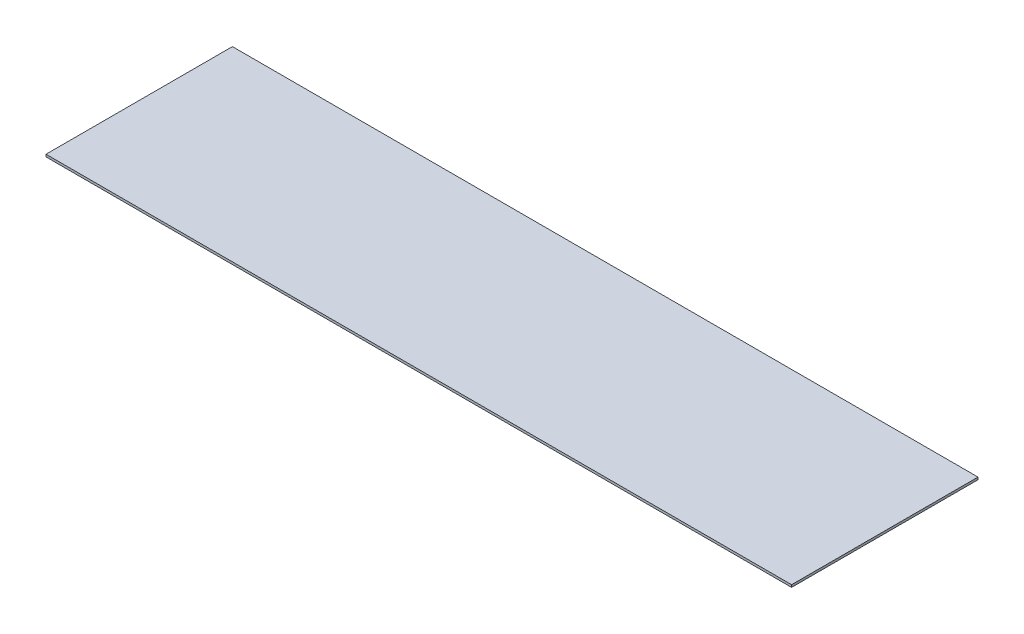
ISO-10303-21;
HEADER;
FILE_DESCRIPTION(('STEP AP214'),'2;1');
FILE_NAME('part.step','',(''),(''),'','','');
FILE_SCHEMA(('AUTOMOTIVE_DESIGN { 1 0 10303 214 1 1 1 1 }'));
ENDSEC;
DATA;
#1=APPLICATION_CONTEXT('core data for automotive mechanical design processes');
#2=APPLICATION_PROTOCOL_DEFINITION('international standard','automotive_design',2000,#1);
#3=PRODUCT_CONTEXT('',#1,'mechanical');
#4=PRODUCT('Part','Part','',(#3));
#5=PRODUCT_RELATED_PRODUCT_CATEGORY('part','',(#4));
#6=PRODUCT_DEFINITION_FORMATION('','',#4);
#7=PRODUCT_DEFINITION_CONTEXT('part definition',#1,'design');
#8=PRODUCT_DEFINITION('design','',#6,#7);
#9=PRODUCT_DEFINITION_SHAPE('','',#8);
#10=(LENGTH_UNIT() NAMED_UNIT(*) SI_UNIT(.MILLI.,.METRE.));
#11=(NAMED_UNIT(*) PLANE_ANGLE_UNIT() SI_UNIT($,.RADIAN.));
#12=(NAMED_UNIT(*) SI_UNIT($,.STERADIAN.) SOLID_ANGLE_UNIT());
#13=UNCERTAINTY_MEASURE_WITH_UNIT(LENGTH_MEASURE(1.E-05),#10,'distance_accuracy_value','');
#14=(GEOMETRIC_REPRESENTATION_CONTEXT(3) GLOBAL_UNCERTAINTY_ASSIGNED_CONTEXT((#13)) GLOBAL_UNIT_ASSIGNED_CONTEXT((#10,
#11,#12)) REPRESENTATION_CONTEXT('',''));
#15=CARTESIAN_POINT('',(0.,0.,0.));
#16=DIRECTION('',(0.,0.,1.));
#17=DIRECTION('',(1.,0.,0.));
#18=AXIS2_PLACEMENT_3D('',#15,#16,#17);
#19=CARTESIAN_POINT('',(0.,1.6,0.));
#20=DIRECTION('',(1.,0.,0.));
#21=DIRECTION('',(0.,0.,-1.));
#22=AXIS2_PLACEMENT_3D('',#19,#20,#21);
#23=PLANE('',#22);
#24=DIRECTION('',(0.,0.,1.));
#25=VECTOR('',#24,1.);
#26=CARTESIAN_POINT('',(0.,0.,0.));
#27=LINE('',#26,#25);
#28=CARTESIAN_POINT('',(0.,0.,-127.));
#29=VERTEX_POINT('',#28);
#30=CARTESIAN_POINT('',(0.,0.,0.));
#31=VERTEX_POINT('',#30);
#32=EDGE_CURVE('E94',#29,#31,#27,.T.);
#33=ORIENTED_EDGE('',*,*,#32,.T.);
#34=DIRECTION('',(0.,-1.,0.));
#35=VECTOR('',#34,1.);
#36=CARTESIAN_POINT('',(0.,1.6,0.));
#37=LINE('',#36,#35);
#38=CARTESIAN_POINT('',(0.,1.6,0.));
#39=VERTEX_POINT('',#38);
#40=EDGE_CURVE('E11',#39,#31,#37,.T.);
#41=ORIENTED_EDGE('',*,*,#40,.F.);
#42=DIRECTION('',(0.,0.,1.));
#43=VECTOR('',#42,1.);
#44=CARTESIAN_POINT('',(0.,1.6,0.));
#45=LINE('',#44,#43);
#46=CARTESIAN_POINT('',(0.,1.6,-127.));
#47=VERTEX_POINT('',#46);
#48=EDGE_CURVE('E82',#47,#39,#45,.T.);
#49=ORIENTED_EDGE('',*,*,#48,.F.);
#50=DIRECTION('',(0.,-1.,0.));
#51=VECTOR('',#50,1.);
#52=CARTESIAN_POINT('',(0.,1.6,-127.));
#53=LINE('',#52,#51);
#54=EDGE_CURVE('E90',#47,#29,#53,.T.);
#55=ORIENTED_EDGE('',*,*,#54,.T.);
#56=EDGE_LOOP('',(#33,#41,#49,#55));
#57=FACE_BOUND('',#56,.T.);
#58=ADVANCED_FACE('F31',(#57),#23,.F.);
#59=CARTESIAN_POINT('',(0.,1.6,0.));
#60=DIRECTION('',(0.,0.,-1.));
#61=DIRECTION('',(-1.,0.,0.));
#62=AXIS2_PLACEMENT_3D('',#59,#60,#61);
#63=PLANE('',#62);
#64=DIRECTION('',(1.,0.,0.));
#65=VECTOR('',#64,1.);
#66=CARTESIAN_POINT('',(0.,0.,0.));
#67=LINE('',#66,#65);
#68=CARTESIAN_POINT('',(508.,0.,0.));
#69=VERTEX_POINT('',#68);
#70=EDGE_CURVE('E86',#31,#69,#67,.T.);
#71=ORIENTED_EDGE('',*,*,#70,.T.);
#72=DIRECTION('',(0.,-1.,0.));
#73=VECTOR('',#72,1.);
#74=CARTESIAN_POINT('',(508.,1.6,0.));
#75=LINE('',#74,#73);
#76=CARTESIAN_POINT('',(508.,1.6,0.));
#77=VERTEX_POINT('',#76);
#78=EDGE_CURVE('E39',#77,#69,#75,.T.);
#79=ORIENTED_EDGE('',*,*,#78,.F.);
#80=DIRECTION('',(1.,0.,0.));
#81=VECTOR('',#80,1.);
#82=CARTESIAN_POINT('',(0.,1.6,0.));
#83=LINE('',#82,#81);
#84=EDGE_CURVE('E77',#39,#77,#83,.T.);
#85=ORIENTED_EDGE('',*,*,#84,.F.);
#86=ORIENTED_EDGE('',*,*,#40,.T.);
#87=EDGE_LOOP('',(#71,#79,#85,#86));
#88=FACE_BOUND('',#87,.T.);
#89=ADVANCED_FACE('F85',(#88),#63,.F.);
#90=CARTESIAN_POINT('',(508.,1.6,0.));
#91=DIRECTION('',(-1.,0.,0.));
#92=DIRECTION('',(0.,0.,1.));
#93=AXIS2_PLACEMENT_3D('',#90,#91,#92);
#94=PLANE('',#93);
#95=DIRECTION('',(0.,0.,-1.));
#96=VECTOR('',#95,1.);
#97=CARTESIAN_POINT('',(508.,0.,0.));
#98=LINE('',#97,#96);
#99=CARTESIAN_POINT('',(508.,0.,-127.));
#100=VERTEX_POINT('',#99);
#101=EDGE_CURVE('E64',#69,#100,#98,.T.);
#102=ORIENTED_EDGE('',*,*,#101,.T.);
#103=DIRECTION('',(0.,-1.,0.));
#104=VECTOR('',#103,1.);
#105=CARTESIAN_POINT('',(508.,1.6,-127.));
#106=LINE('',#105,#104);
#107=CARTESIAN_POINT('',(508.,1.6,-127.));
#108=VERTEX_POINT('',#107);
#109=EDGE_CURVE('E87',#108,#100,#106,.T.);
#110=ORIENTED_EDGE('',*,*,#109,.F.);
#111=DIRECTION('',(0.,0.,-1.));
#112=VECTOR('',#111,1.);
#113=CARTESIAN_POINT('',(508.,1.6,0.));
#114=LINE('',#113,#112);
#115=EDGE_CURVE('E80',#77,#108,#114,.T.);
#116=ORIENTED_EDGE('',*,*,#115,.F.);
#117=ORIENTED_EDGE('',*,*,#78,.T.);
#118=EDGE_LOOP('',(#102,#110,#116,#117));
#119=FACE_BOUND('',#118,.T.);
#120=ADVANCED_FACE('F88',(#119),#94,.F.);
#121=CARTESIAN_POINT('',(0.,1.6,-127.));
#122=DIRECTION('',(0.,0.,1.));
#123=DIRECTION('',(1.,0.,0.));
#124=AXIS2_PLACEMENT_3D('',#121,#122,#123);
#125=PLANE('',#124);
#126=DIRECTION('',(-1.,0.,0.));
#127=VECTOR('',#126,1.);
#128=CARTESIAN_POINT('',(0.,0.,-127.));
#129=LINE('',#128,#127);
#130=EDGE_CURVE('E70',#100,#29,#129,.T.);
#131=ORIENTED_EDGE('',*,*,#130,.T.);
#132=ORIENTED_EDGE('',*,*,#54,.F.);
#133=DIRECTION('',(-1.,0.,0.));
#134=VECTOR('',#133,1.);
#135=CARTESIAN_POINT('',(0.,1.6,-127.));
#136=LINE('',#135,#134);
#137=EDGE_CURVE('E47',#108,#47,#136,.T.);
#138=ORIENTED_EDGE('',*,*,#137,.F.);
#139=ORIENTED_EDGE('',*,*,#109,.T.);
#140=EDGE_LOOP('',(#131,#132,#138,#139));
#141=FACE_BOUND('',#140,.T.);
#142=ADVANCED_FACE('F101',(#141),#125,.F.);
#143=CARTESIAN_POINT('',(0.,1.6,-127.));
#144=DIRECTION('',(0.,-1.,0.));
#145=DIRECTION('',(0.,0.,-1.));
#146=AXIS2_PLACEMENT_3D('',#143,#144,#145);
#147=PLANE('',#146);
#148=ORIENTED_EDGE('',*,*,#48,.T.);
#149=ORIENTED_EDGE('',*,*,#84,.T.);
#150=ORIENTED_EDGE('',*,*,#115,.T.);
#151=ORIENTED_EDGE('',*,*,#137,.T.);
#152=EDGE_LOOP('',(#148,#149,#150,#151));
#153=FACE_BOUND('',#152,.T.);
#154=ADVANCED_FACE('F78',(#153),#147,.F.);
#155=CARTESIAN_POINT('',(0.,0.,-127.));
#156=DIRECTION('',(0.,-1.,0.));
#157=DIRECTION('',(0.,0.,-1.));
#158=AXIS2_PLACEMENT_3D('',#155,#156,#157);
#159=PLANE('',#158);
#160=ORIENTED_EDGE('',*,*,#32,.F.);
#161=ORIENTED_EDGE('',*,*,#130,.F.);
#162=ORIENTED_EDGE('',*,*,#101,.F.);
#163=ORIENTED_EDGE('',*,*,#70,.F.);
#164=EDGE_LOOP('',(#160,#161,#162,#163));
#165=FACE_BOUND('',#164,.T.);
#166=ADVANCED_FACE('F104',(#165),#159,.T.);
#167=CLOSED_SHELL('',(#58,#89,#120,#142,#154,#166));
#168=MANIFOLD_SOLID_BREP('B2',#167);
#169=ADVANCED_BREP_SHAPE_REPRESENTATION('',(#18,#168),#14);
#170=SHAPE_DEFINITION_REPRESENTATION(#9,#169);
ENDSEC;
END-ISO-10303-21;
